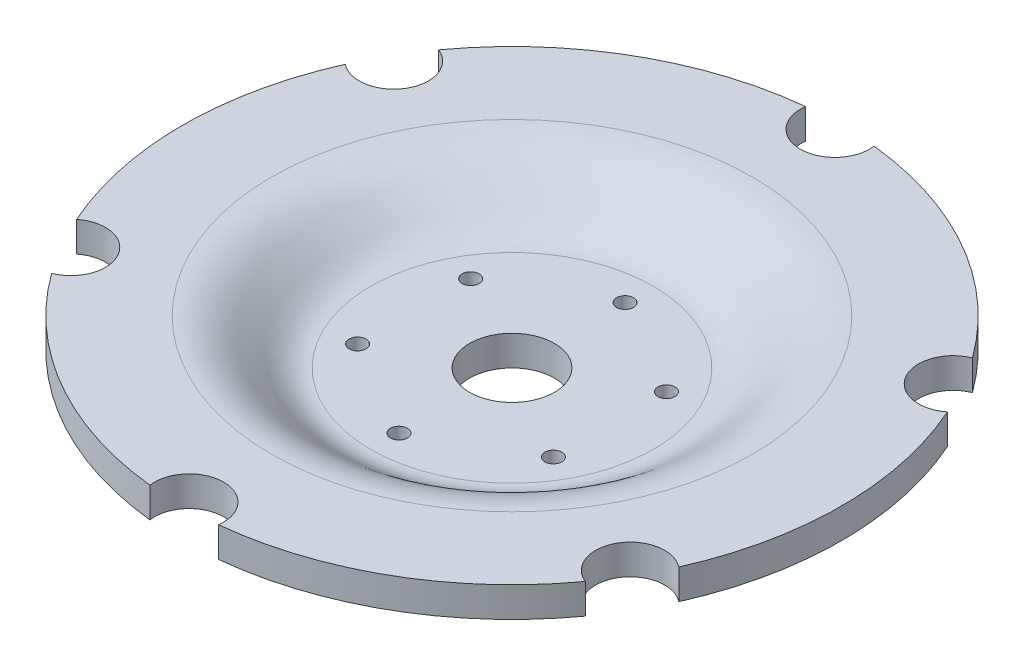
ISO-10303-21;
HEADER;
FILE_DESCRIPTION(('STEP AP214'),'2;1');
FILE_NAME('part.step','',(''),(''),'','','');
FILE_SCHEMA(('AUTOMOTIVE_DESIGN { 1 0 10303 214 1 1 1 1 }'));
ENDSEC;
DATA;
#1=APPLICATION_CONTEXT('core data for automotive mechanical design processes');
#2=APPLICATION_PROTOCOL_DEFINITION('international standard','automotive_design',2000,#1);
#3=PRODUCT_CONTEXT('',#1,'mechanical');
#4=PRODUCT('Part','Part','',(#3));
#5=PRODUCT_RELATED_PRODUCT_CATEGORY('part','',(#4));
#6=PRODUCT_DEFINITION_FORMATION('','',#4);
#7=PRODUCT_DEFINITION_CONTEXT('part definition',#1,'design');
#8=PRODUCT_DEFINITION('design','',#6,#7);
#9=PRODUCT_DEFINITION_SHAPE('','',#8);
#10=(LENGTH_UNIT() NAMED_UNIT(*) SI_UNIT(.MILLI.,.METRE.));
#11=(NAMED_UNIT(*) PLANE_ANGLE_UNIT() SI_UNIT($,.RADIAN.));
#12=(NAMED_UNIT(*) SI_UNIT($,.STERADIAN.) SOLID_ANGLE_UNIT());
#13=UNCERTAINTY_MEASURE_WITH_UNIT(LENGTH_MEASURE(1.E-05),#10,'distance_accuracy_value','');
#14=(GEOMETRIC_REPRESENTATION_CONTEXT(3) GLOBAL_UNCERTAINTY_ASSIGNED_CONTEXT((#13)) GLOBAL_UNIT_ASSIGNED_CONTEXT((#10,
#11,#12)) REPRESENTATION_CONTEXT('',''));
#15=CARTESIAN_POINT('',(0.,0.,0.));
#16=DIRECTION('',(0.,0.,1.));
#17=DIRECTION('',(1.,0.,0.));
#18=AXIS2_PLACEMENT_3D('',#15,#16,#17);
#19=CARTESIAN_POINT('',(0.,-21.28,0.));
#20=DIRECTION('',(0.,-1.,0.));
#21=DIRECTION('',(0.,0.,-1.));
#22=AXIS2_PLACEMENT_3D('',#19,#20,#21);
#23=PLANE('',#22);
#24=CARTESIAN_POINT('',(0.,-21.28,0.));
#25=DIRECTION('',(0.,1.,0.));
#26=DIRECTION('',(0.,0.,1.));
#27=AXIS2_PLACEMENT_3D('',#24,#25,#26);
#28=CIRCLE('',#27,14.1);
#29=CARTESIAN_POINT('',(0.,-21.28,14.1));
#30=VERTEX_POINT('',#29);
#31=EDGE_CURVE('E285',#30,#30,#28,.T.);
#32=ORIENTED_EDGE('',*,*,#31,.T.);
#33=EDGE_LOOP('',(#32));
#34=FACE_BOUND('',#33,.T.);
#35=CARTESIAN_POINT('',(-32.5625551822947,-21.28,-18.8000000000004));
#36=DIRECTION('',(0.,1.,0.));
#37=DIRECTION('',(0.,0.,1.));
#38=AXIS2_PLACEMENT_3D('',#35,#36,#37);
#39=CIRCLE('',#38,2.82);
#40=CARTESIAN_POINT('',(-32.5625551822947,-21.28,-15.9800000000004));
#41=VERTEX_POINT('',#40);
#42=EDGE_CURVE('E289',#41,#41,#39,.T.);
#43=ORIENTED_EDGE('',*,*,#42,.T.);
#44=EDGE_LOOP('',(#43));
#45=FACE_BOUND('',#44,.T.);
#46=CARTESIAN_POINT('',(0.,-21.28,-37.6));
#47=DIRECTION('',(0.,1.,0.));
#48=DIRECTION('',(0.,0.,1.));
#49=AXIS2_PLACEMENT_3D('',#46,#47,#48);
#50=CIRCLE('',#49,2.82);
#51=CARTESIAN_POINT('',(0.,-21.28,-34.78));
#52=VERTEX_POINT('',#51);
#53=EDGE_CURVE('E293',#52,#52,#50,.T.);
#54=ORIENTED_EDGE('',*,*,#53,.T.);
#55=EDGE_LOOP('',(#54));
#56=FACE_BOUND('',#55,.T.);
#57=CARTESIAN_POINT('',(32.562555182295,-21.28,-18.8));
#58=DIRECTION('',(0.,1.,0.));
#59=DIRECTION('',(0.,0.,1.));
#60=AXIS2_PLACEMENT_3D('',#57,#58,#59);
#61=CIRCLE('',#60,2.82);
#62=CARTESIAN_POINT('',(32.562555182295,-21.28,-15.98));
#63=VERTEX_POINT('',#62);
#64=EDGE_CURVE('E297',#63,#63,#61,.T.);
#65=ORIENTED_EDGE('',*,*,#64,.T.);
#66=EDGE_LOOP('',(#65));
#67=FACE_BOUND('',#66,.T.);
#68=CARTESIAN_POINT('',(32.5625551822981,-21.28,18.7999999999981));
#69=DIRECTION('',(0.,1.,0.));
#70=DIRECTION('',(0.,0.,1.));
#71=AXIS2_PLACEMENT_3D('',#68,#69,#70);
#72=CIRCLE('',#71,2.82);
#73=CARTESIAN_POINT('',(32.5625551822981,-21.28,21.6199999999981));
#74=VERTEX_POINT('',#73);
#75=EDGE_CURVE('E301',#74,#74,#72,.T.);
#76=ORIENTED_EDGE('',*,*,#75,.T.);
#77=EDGE_LOOP('',(#76));
#78=FACE_BOUND('',#77,.T.);
#79=CARTESIAN_POINT('',(0.,-21.28,0.));
#80=DIRECTION('',(0.,1.,0.));
#81=DIRECTION('',(0.,0.,1.));
#82=AXIS2_PLACEMENT_3D('',#79,#80,#81);
#83=CIRCLE('',#82,47.0000000000002);
#84=CARTESIAN_POINT('',(0.,-21.28,47.0000000000002));
#85=VERTEX_POINT('',#84);
#86=EDGE_CURVE('E203',#85,#85,#83,.T.);
#87=ORIENTED_EDGE('',*,*,#86,.F.);
#88=EDGE_LOOP('',(#87));
#89=FACE_BOUND('',#88,.T.);
#90=CARTESIAN_POINT('',(-32.5625551822917,-21.28,18.8000000000019));
#91=DIRECTION('',(0.,1.,0.));
#92=DIRECTION('',(0.,0.,1.));
#93=AXIS2_PLACEMENT_3D('',#90,#91,#92);
#94=CIRCLE('',#93,2.82);
#95=CARTESIAN_POINT('',(-32.5625551822917,-21.28,21.6200000000018));
#96=VERTEX_POINT('',#95);
#97=EDGE_CURVE('E307',#96,#96,#94,.T.);
#98=ORIENTED_EDGE('',*,*,#97,.T.);
#99=EDGE_LOOP('',(#98));
#100=FACE_BOUND('',#99,.T.);
#101=CARTESIAN_POINT('',(4.26541575440318E-12,-21.28,37.6));
#102=DIRECTION('',(0.,1.,0.));
#103=DIRECTION('',(0.,0.,1.));
#104=AXIS2_PLACEMENT_3D('',#101,#102,#103);
#105=CIRCLE('',#104,2.82);
#106=CARTESIAN_POINT('',(4.26541575440318E-12,-21.28,40.42));
#107=VERTEX_POINT('',#106);
#108=EDGE_CURVE('E310',#107,#107,#105,.T.);
#109=ORIENTED_EDGE('',*,*,#108,.T.);
#110=EDGE_LOOP('',(#109));
#111=FACE_BOUND('',#110,.T.);
#112=ADVANCED_FACE('F45',(#34,#45,#56,#67,#78,#89,#100,#111),#23,.T.);
#113=CARTESIAN_POINT('',(0.,-15.0433244229354,0.));
#114=DIRECTION('',(0.,1.,0.));
#115=DIRECTION('',(0.,0.,1.));
#116=AXIS2_PLACEMENT_3D('',#113,#114,#115);
#117=CYLINDRICAL_SURFACE('',#116,109.626011544447);
#118=DIRECTION('',(0.,1.,0.));
#119=VECTOR('',#118,1.);
#120=CARTESIAN_POINT('',(-100.116479710272,-8.76000000000002,-44.6604175704388));
#121=LINE('',#120,#119);
#122=CARTESIAN_POINT('',(-100.116479710272,-6.24000000000001,-44.6604175704389));
#123=VERTEX_POINT('',#122);
#124=CARTESIAN_POINT('',(-100.116479710272,3.75999999999999,-44.6604175704389));
#125=VERTEX_POINT('',#124);
#126=EDGE_CURVE('E59',#123,#125,#121,.T.);
#127=ORIENTED_EDGE('',*,*,#126,.F.);
#128=CARTESIAN_POINT('',(0.,-6.24,0.));
#129=DIRECTION('',(0.,1.,0.));
#130=DIRECTION('',(0.,0.,1.));
#131=AXIS2_PLACEMENT_3D('',#128,#129,#130);
#132=CIRCLE('',#131,109.626011544447);
#133=CARTESIAN_POINT('',(-100.11647971027,-6.24,44.6604175704429));
#134=VERTEX_POINT('',#133);
#135=EDGE_CURVE('E170',#123,#134,#132,.T.);
#136=ORIENTED_EDGE('',*,*,#135,.T.);
#137=DIRECTION('',(0.,1.,0.));
#138=VECTOR('',#137,1.);
#139=CARTESIAN_POINT('',(-100.11647971027,-8.76,44.6604175704429));
#140=LINE('',#139,#138);
#141=CARTESIAN_POINT('',(-100.11647971027,3.76000000000001,44.6604175704429));
#142=VERTEX_POINT('',#141);
#143=EDGE_CURVE('E200',#142,#134,#140,.F.);
#144=ORIENTED_EDGE('',*,*,#143,.F.);
#145=CARTESIAN_POINT('',(0.,3.76,0.));
#146=DIRECTION('',(0.,1.,0.));
#147=DIRECTION('',(0.,0.,1.));
#148=AXIS2_PLACEMENT_3D('',#145,#146,#147);
#149=CIRCLE('',#148,109.626011544447);
#150=EDGE_CURVE('E153',#125,#142,#149,.T.);
#151=ORIENTED_EDGE('',*,*,#150,.F.);
#152=EDGE_LOOP('',(#127,#136,#144,#151));
#153=FACE_BOUND('',#152,.T.);
#154=ADVANCED_FACE('F270',(#153),#117,.T.);
#155=DIRECTION('',(0.,1.,0.));
#156=VECTOR('',#155,1.);
#157=CARTESIAN_POINT('',(100.116479710273,-8.76,44.6604175704364));
#158=LINE('',#157,#156);
#159=CARTESIAN_POINT('',(100.116479710273,-6.23999999999999,44.6604175704365));
#160=VERTEX_POINT('',#159);
#161=CARTESIAN_POINT('',(100.116479710273,3.76000000000001,44.6604175704365));
#162=VERTEX_POINT('',#161);
#163=EDGE_CURVE('E67',#160,#162,#158,.T.);
#164=ORIENTED_EDGE('',*,*,#163,.F.);
#165=CARTESIAN_POINT('',(100.116479710271,-6.24000000000001,-44.6604175704404));
#166=VERTEX_POINT('',#165);
#167=EDGE_CURVE('E190',#160,#166,#132,.T.);
#168=ORIENTED_EDGE('',*,*,#167,.T.);
#169=DIRECTION('',(0.,1.,0.));
#170=VECTOR('',#169,1.);
#171=CARTESIAN_POINT('',(100.116479710271,-8.76000000000002,-44.6604175704404));
#172=LINE('',#171,#170);
#173=CARTESIAN_POINT('',(100.116479710271,3.75999999999999,-44.6604175704404));
#174=VERTEX_POINT('',#173);
#175=EDGE_CURVE('E183',#174,#166,#172,.F.);
#176=ORIENTED_EDGE('',*,*,#175,.F.);
#177=EDGE_CURVE('E156',#162,#174,#149,.T.);
#178=ORIENTED_EDGE('',*,*,#177,.F.);
#179=EDGE_LOOP('',(#164,#168,#176,#178));
#180=FACE_BOUND('',#179,.T.);
#181=ADVANCED_FACE('F188',(#180),#117,.T.);
#182=DIRECTION('',(0.,1.,0.));
#183=VECTOR('',#182,1.);
#184=CARTESIAN_POINT('',(88.7352960147567,-8.76000000000002,-64.3732059813459));
#185=LINE('',#184,#183);
#186=CARTESIAN_POINT('',(88.7352960147567,-6.24000000000001,-64.3732059813458));
#187=VERTEX_POINT('',#186);
#188=CARTESIAN_POINT('',(88.7352960147567,3.75999999999999,-64.3732059813458));
#189=VERTEX_POINT('',#188);
#190=EDGE_CURVE('E53',#187,#189,#185,.T.);
#191=ORIENTED_EDGE('',*,*,#190,.F.);
#192=CARTESIAN_POINT('',(11.3811836955142,-6.24000000000002,-109.033623551784));
#193=VERTEX_POINT('',#192);
#194=EDGE_CURVE('E213',#187,#193,#132,.T.);
#195=ORIENTED_EDGE('',*,*,#194,.T.);
#196=DIRECTION('',(0.,1.,0.));
#197=VECTOR('',#196,1.);
#198=CARTESIAN_POINT('',(11.3811836955142,-8.76000000000003,-109.033623551784));
#199=LINE('',#198,#197);
#200=CARTESIAN_POINT('',(11.3811836955142,3.75999999999998,-109.033623551784));
#201=VERTEX_POINT('',#200);
#202=EDGE_CURVE('E193',#201,#193,#199,.F.);
#203=ORIENTED_EDGE('',*,*,#202,.F.);
#204=EDGE_CURVE('E152',#189,#201,#149,.T.);
#205=ORIENTED_EDGE('',*,*,#204,.F.);
#206=EDGE_LOOP('',(#191,#195,#203,#205));
#207=FACE_BOUND('',#206,.T.);
#208=ADVANCED_FACE('F220',(#207),#117,.T.);
#209=DIRECTION('',(0.,1.,0.));
#210=VECTOR('',#209,1.);
#211=CARTESIAN_POINT('',(-88.7352960147583,-8.76000000000002,-64.3732059813435));
#212=LINE('',#211,#210);
#213=CARTESIAN_POINT('',(-88.7352960147583,3.75999999999999,-64.3732059813435));
#214=VERTEX_POINT('',#213);
#215=CARTESIAN_POINT('',(-88.7352960147583,-6.24000000000001,-64.3732059813435));
#216=VERTEX_POINT('',#215);
#217=EDGE_CURVE('E132',#214,#216,#212,.F.);
#218=ORIENTED_EDGE('',*,*,#217,.F.);
#219=CARTESIAN_POINT('',(-11.3811836955142,3.75999999999998,-109.033623551784));
#220=VERTEX_POINT('',#219);
#221=EDGE_CURVE('E142',#220,#214,#149,.T.);
#222=ORIENTED_EDGE('',*,*,#221,.F.);
#223=DIRECTION('',(0.,1.,0.));
#224=VECTOR('',#223,1.);
#225=CARTESIAN_POINT('',(-11.3811836955142,-8.76000000000003,-109.033623551784));
#226=LINE('',#225,#224);
#227=CARTESIAN_POINT('',(-11.3811836955142,-6.24000000000002,-109.033623551784));
#228=VERTEX_POINT('',#227);
#229=EDGE_CURVE('E191',#228,#220,#226,.T.);
#230=ORIENTED_EDGE('',*,*,#229,.F.);
#231=EDGE_CURVE('E144',#228,#216,#132,.T.);
#232=ORIENTED_EDGE('',*,*,#231,.T.);
#233=EDGE_LOOP('',(#218,#222,#230,#232));
#234=FACE_BOUND('',#233,.T.);
#235=ADVANCED_FACE('F140',(#234),#117,.T.);
#236=DIRECTION('',(0.,1.,0.));
#237=VECTOR('',#236,1.);
#238=CARTESIAN_POINT('',(-88.7352960147557,-8.76,64.3732059813472));
#239=LINE('',#238,#237);
#240=CARTESIAN_POINT('',(-88.7352960147557,-6.23999999999999,64.3732059813472));
#241=VERTEX_POINT('',#240);
#242=CARTESIAN_POINT('',(-88.7352960147557,3.76000000000001,64.3732059813472));
#243=VERTEX_POINT('',#242);
#244=EDGE_CURVE('E198',#241,#243,#239,.T.);
#245=ORIENTED_EDGE('',*,*,#244,.F.);
#246=CARTESIAN_POINT('',(-11.3811836954952,-6.23999999999998,109.033623551786));
#247=VERTEX_POINT('',#246);
#248=EDGE_CURVE('E168',#241,#247,#132,.T.);
#249=ORIENTED_EDGE('',*,*,#248,.T.);
#250=DIRECTION('',(0.,1.,0.));
#251=VECTOR('',#250,1.);
#252=CARTESIAN_POINT('',(-11.3811836954952,-8.75999999999999,109.033623551786));
#253=LINE('',#252,#251);
#254=CARTESIAN_POINT('',(-11.3811836954952,3.76000000000002,109.033623551786));
#255=VERTEX_POINT('',#254);
#256=EDGE_CURVE('E239',#255,#247,#253,.F.);
#257=ORIENTED_EDGE('',*,*,#256,.F.);
#258=EDGE_CURVE('E155',#243,#255,#149,.T.);
#259=ORIENTED_EDGE('',*,*,#258,.F.);
#260=EDGE_LOOP('',(#245,#249,#257,#259));
#261=FACE_BOUND('',#260,.T.);
#262=ADVANCED_FACE('F271',(#261),#117,.T.);
#263=CARTESIAN_POINT('',(0.,-11.28,0.));
#264=DIRECTION('',(0.,1.,0.));
#265=DIRECTION('',(0.,0.,1.));
#266=AXIS2_PLACEMENT_3D('',#263,#264,#265);
#267=PLANE('',#266);
#268=CARTESIAN_POINT('',(0.,-11.28,0.));
#269=DIRECTION('',(0.,1.,0.));
#270=DIRECTION('',(0.,0.,1.));
#271=AXIS2_PLACEMENT_3D('',#268,#269,#270);
#272=CIRCLE('',#271,14.1);
#273=CARTESIAN_POINT('',(0.,-11.28,14.1));
#274=VERTEX_POINT('',#273);
#275=EDGE_CURVE('E384',#274,#274,#272,.T.);
#276=ORIENTED_EDGE('',*,*,#275,.F.);
#277=EDGE_LOOP('',(#276));
#278=FACE_BOUND('',#277,.T.);
#279=CARTESIAN_POINT('',(-32.5625551822947,-11.28,-18.8000000000004));
#280=DIRECTION('',(0.,1.,0.));
#281=DIRECTION('',(0.,0.,1.));
#282=AXIS2_PLACEMENT_3D('',#279,#280,#281);
#283=CIRCLE('',#282,2.81999999999999);
#284=CARTESIAN_POINT('',(-32.5625551822947,-11.28,-15.9800000000004));
#285=VERTEX_POINT('',#284);
#286=EDGE_CURVE('E387',#285,#285,#283,.T.);
#287=ORIENTED_EDGE('',*,*,#286,.F.);
#288=EDGE_LOOP('',(#287));
#289=FACE_BOUND('',#288,.T.);
#290=CARTESIAN_POINT('',(0.,-11.28,-37.6));
#291=DIRECTION('',(0.,1.,0.));
#292=DIRECTION('',(0.,0.,1.));
#293=AXIS2_PLACEMENT_3D('',#290,#291,#292);
#294=CIRCLE('',#293,2.81999999999999);
#295=CARTESIAN_POINT('',(0.,-11.28,-34.78));
#296=VERTEX_POINT('',#295);
#297=EDGE_CURVE('E393',#296,#296,#294,.T.);
#298=ORIENTED_EDGE('',*,*,#297,.F.);
#299=EDGE_LOOP('',(#298));
#300=FACE_BOUND('',#299,.T.);
#301=CARTESIAN_POINT('',(32.562555182295,-11.28,-18.8));
#302=DIRECTION('',(0.,1.,0.));
#303=DIRECTION('',(0.,0.,1.));
#304=AXIS2_PLACEMENT_3D('',#301,#302,#303);
#305=CIRCLE('',#304,2.81999999999999);
#306=CARTESIAN_POINT('',(32.562555182295,-11.28,-15.98));
#307=VERTEX_POINT('',#306);
#308=EDGE_CURVE('E397',#307,#307,#305,.T.);
#309=ORIENTED_EDGE('',*,*,#308,.F.);
#310=EDGE_LOOP('',(#309));
#311=FACE_BOUND('',#310,.T.);
#312=CARTESIAN_POINT('',(32.5625551822981,-11.28,18.7999999999981));
#313=DIRECTION('',(0.,1.,0.));
#314=DIRECTION('',(0.,0.,1.));
#315=AXIS2_PLACEMENT_3D('',#312,#313,#314);
#316=CIRCLE('',#315,2.81999999999999);
#317=CARTESIAN_POINT('',(32.5625551822981,-11.28,21.6199999999981));
#318=VERTEX_POINT('',#317);
#319=EDGE_CURVE('E401',#318,#318,#316,.T.);
#320=ORIENTED_EDGE('',*,*,#319,.F.);
#321=EDGE_LOOP('',(#320));
#322=FACE_BOUND('',#321,.T.);
#323=CARTESIAN_POINT('',(4.26541575440318E-12,-11.28,37.6));
#324=DIRECTION('',(0.,1.,0.));
#325=DIRECTION('',(0.,0.,1.));
#326=AXIS2_PLACEMENT_3D('',#323,#324,#325);
#327=CIRCLE('',#326,2.81999999999999);
#328=CARTESIAN_POINT('',(4.26541575440318E-12,-11.28,40.42));
#329=VERTEX_POINT('',#328);
#330=EDGE_CURVE('E313',#329,#329,#327,.T.);
#331=ORIENTED_EDGE('',*,*,#330,.F.);
#332=EDGE_LOOP('',(#331));
#333=FACE_BOUND('',#332,.T.);
#334=CARTESIAN_POINT('',(-32.5625551822917,-11.28,18.8000000000019));
#335=DIRECTION('',(0.,1.,0.));
#336=DIRECTION('',(0.,0.,1.));
#337=AXIS2_PLACEMENT_3D('',#334,#335,#336);
#338=CIRCLE('',#337,2.81999999999999);
#339=CARTESIAN_POINT('',(-32.5625551822917,-11.28,21.6200000000018));
#340=VERTEX_POINT('',#339);
#341=EDGE_CURVE('E312',#340,#340,#338,.T.);
#342=ORIENTED_EDGE('',*,*,#341,.F.);
#343=EDGE_LOOP('',(#342));
#344=FACE_BOUND('',#343,.T.);
#345=CARTESIAN_POINT('',(0.,-11.28,0.));
#346=DIRECTION('',(0.,1.,0.));
#347=DIRECTION('',(0.,0.,1.));
#348=AXIS2_PLACEMENT_3D('',#345,#346,#347);
#349=CIRCLE('',#348,47.);
#350=CARTESIAN_POINT('',(0.,-11.28,47.));
#351=VERTEX_POINT('',#350);
#352=EDGE_CURVE('E166',#351,#351,#349,.T.);
#353=ORIENTED_EDGE('',*,*,#352,.T.);
#354=EDGE_LOOP('',(#353));
#355=FACE_BOUND('',#354,.T.);
#356=ADVANCED_FACE('F47',(#278,#289,#300,#311,#322,#333,#344,#355),#267,.T.);
#357=CARTESIAN_POINT('',(79.9,-6.24,0.));
#358=CARTESIAN_POINT('',(79.5814219048359,-6.24,0.));
#359=CARTESIAN_POINT('',(78.9274629999967,-6.26135514550307,0.));
#360=CARTESIAN_POINT('',(77.7578426696443,-6.37664196986913,0.));
#361=CARTESIAN_POINT('',(76.3667583016656,-6.65192998526286,0.));
#362=CARTESIAN_POINT('',(74.8239491144071,-7.16288550630177,0.));
#363=CARTESIAN_POINT('',(72.7883973936226,-8.09443504718028,0.));
#364=CARTESIAN_POINT('',(70.2209148985642,-9.72699602605355,0.));
#365=CARTESIAN_POINT('',(66.9206940326988,-12.3328310892076,0.));
#366=CARTESIAN_POINT('',(63.2491847703619,-15.3017782132427,0.));
#367=CARTESIAN_POINT('',(59.6386253805314,-17.7605205155428,0.));
#368=CARTESIAN_POINT('',(56.2437732055035,-19.4391988412004,0.));
#369=CARTESIAN_POINT('',(53.4143313725907,-20.4534612437412,0.));
#370=CARTESIAN_POINT('',(50.3552086088509,-21.1198170005363,0.));
#371=CARTESIAN_POINT('',(48.1033977983843,-21.28,0.));
#372=CARTESIAN_POINT('',(47.0000000000002,-21.28,0.));
#373=B_SPLINE_CURVE_WITH_KNOTS('',3,(#357,#358,#359,#360,#361,#362,#363,#364,#365,#366,#367,
#368,#369,#370,#371,#372),.UNSPECIFIED.,.F.,.F.,(4,1,1,1,1,1,1,1,1,1,1,1,1,4),(0.,0.03125,
0.0625,0.125,0.1875,0.25,0.375,0.5,0.625,0.75,0.8125,0.875,0.9375,1.),.UNSPECIFIED.);
#374=CARTESIAN_POINT('',(0.,-15.0433244229354,0.));
#375=DIRECTION('',(0.,1.,0.));
#376=AXIS1_PLACEMENT('',#374,#375);
#377=SURFACE_OF_REVOLUTION('',#373,#376);
#378=ORIENTED_EDGE('',*,*,#86,.T.);
#379=EDGE_LOOP('',(#378));
#380=FACE_BOUND('',#379,.T.);
#381=CARTESIAN_POINT('',(0.,-6.24,0.));
#382=DIRECTION('',(0.,1.,0.));
#383=DIRECTION('',(0.,0.,1.));
#384=AXIS2_PLACEMENT_3D('',#381,#382,#383);
#385=CIRCLE('',#384,79.9);
#386=CARTESIAN_POINT('',(0.,-6.23999999999999,79.9));
#387=VERTEX_POINT('',#386);
#388=EDGE_CURVE('E206',#387,#387,#385,.T.);
#389=ORIENTED_EDGE('',*,*,#388,.F.);
#390=EDGE_LOOP('',(#389));
#391=FACE_BOUND('',#390,.T.);
#392=ADVANCED_FACE('F274',(#380,#391),#377,.F.);
#393=CARTESIAN_POINT('',(79.9,-6.24,0.));
#394=DIRECTION('',(0.,-1.,0.));
#395=DIRECTION('',(0.,0.,-1.));
#396=AXIS2_PLACEMENT_3D('',#393,#394,#395);
#397=PLANE('',#396);
#398=CARTESIAN_POINT('',(-92.9979546474359,-6.24000000000001,-53.6923941497804));
#399=DIRECTION('',(0.,-1.,0.));
#400=DIRECTION('',(0.,0.,-1.));
#401=AXIS2_PLACEMENT_3D('',#398,#399,#400);
#402=CIRCLE('',#401,11.5);
#403=EDGE_CURVE('E145',#216,#123,#402,.T.);
#404=ORIENTED_EDGE('',*,*,#403,.F.);
#405=ORIENTED_EDGE('',*,*,#231,.F.);
#406=CARTESIAN_POINT('',(0.,-6.24000000000002,-107.384788299565));
#407=DIRECTION('',(0.,-1.,0.));
#408=DIRECTION('',(0.,0.,-1.));
#409=AXIS2_PLACEMENT_3D('',#406,#407,#408);
#410=CIRCLE('',#409,11.5);
#411=EDGE_CURVE('E225',#193,#228,#410,.T.);
#412=ORIENTED_EDGE('',*,*,#411,.F.);
#413=ORIENTED_EDGE('',*,*,#194,.F.);
#414=CARTESIAN_POINT('',(92.997954647438,-6.24000000000001,-53.6923941497842));
#415=DIRECTION('',(0.,-1.,0.));
#416=DIRECTION('',(0.,0.,-1.));
#417=AXIS2_PLACEMENT_3D('',#414,#415,#416);
#418=CIRCLE('',#417,11.5);
#419=EDGE_CURVE('E186',#166,#187,#418,.T.);
#420=ORIENTED_EDGE('',*,*,#419,.F.);
#421=ORIENTED_EDGE('',*,*,#167,.F.);
#422=CARTESIAN_POINT('',(92.9979546474402,-6.23999999999999,53.6923941497805));
#423=DIRECTION('',(0.,-1.,0.));
#424=DIRECTION('',(0.,0.,-1.));
#425=AXIS2_PLACEMENT_3D('',#422,#423,#424);
#426=CIRCLE('',#425,11.5);
#427=CARTESIAN_POINT('',(88.7352960147592,-6.23999999999999,64.3732059813423));
#428=VERTEX_POINT('',#427);
#429=EDGE_CURVE('E327',#428,#160,#426,.T.);
#430=ORIENTED_EDGE('',*,*,#429,.F.);
#431=CARTESIAN_POINT('',(11.3811836955352,-6.23999999999999,109.033623551782));
#432=VERTEX_POINT('',#431);
#433=EDGE_CURVE('E171',#432,#428,#132,.T.);
#434=ORIENTED_EDGE('',*,*,#433,.F.);
#435=CARTESIAN_POINT('',(1.96214344722274E-11,-6.23999999999999,107.384788299571));
#436=DIRECTION('',(0.,-1.,0.));
#437=DIRECTION('',(0.,0.,-1.));
#438=AXIS2_PLACEMENT_3D('',#435,#436,#437);
#439=CIRCLE('',#438,11.5);
#440=EDGE_CURVE('E242',#247,#432,#439,.T.);
#441=ORIENTED_EDGE('',*,*,#440,.F.);
#442=ORIENTED_EDGE('',*,*,#248,.F.);
#443=CARTESIAN_POINT('',(-92.9979546474337,-6.23999999999999,53.6923941497842));
#444=DIRECTION('',(0.,-1.,0.));
#445=DIRECTION('',(0.,0.,-1.));
#446=AXIS2_PLACEMENT_3D('',#443,#444,#445);
#447=CIRCLE('',#446,11.5);
#448=EDGE_CURVE('E231',#134,#241,#447,.T.);
#449=ORIENTED_EDGE('',*,*,#448,.F.);
#450=ORIENTED_EDGE('',*,*,#135,.F.);
#451=EDGE_LOOP('',(#404,#405,#412,#413,#420,#421,#430,#434,#441,#442,#449,#450));
#452=FACE_BOUND('',#451,.T.);
#453=ORIENTED_EDGE('',*,*,#388,.T.);
#454=EDGE_LOOP('',(#453));
#455=FACE_BOUND('',#454,.T.);
#456=ADVANCED_FACE('F226',(#452,#455),#397,.T.);
#457=DIRECTION('',(0.,1.,0.));
#458=VECTOR('',#457,1.);
#459=CARTESIAN_POINT('',(88.7352960147592,-8.76,64.3732059813423));
#460=LINE('',#459,#458);
#461=CARTESIAN_POINT('',(88.7352960147592,3.76000000000001,64.3732059813423));
#462=VERTEX_POINT('',#461);
#463=EDGE_CURVE('E325',#462,#428,#460,.F.);
#464=ORIENTED_EDGE('',*,*,#463,.F.);
#465=CARTESIAN_POINT('',(11.3811836955352,3.76000000000002,109.033623551782));
#466=VERTEX_POINT('',#465);
#467=EDGE_CURVE('E157',#466,#462,#149,.T.);
#468=ORIENTED_EDGE('',*,*,#467,.F.);
#469=DIRECTION('',(0.,1.,0.));
#470=VECTOR('',#469,1.);
#471=CARTESIAN_POINT('',(11.3811836955351,-8.75999999999999,109.033623551782));
#472=LINE('',#471,#470);
#473=EDGE_CURVE('E244',#432,#466,#472,.T.);
#474=ORIENTED_EDGE('',*,*,#473,.F.);
#475=ORIENTED_EDGE('',*,*,#433,.T.);
#476=EDGE_LOOP('',(#464,#468,#474,#475));
#477=FACE_BOUND('',#476,.T.);
#478=ADVANCED_FACE('F267',(#477),#117,.T.);
#479=CARTESIAN_POINT('',(79.9,3.76,0.));
#480=DIRECTION('',(0.,1.,0.));
#481=DIRECTION('',(0.,0.,1.));
#482=AXIS2_PLACEMENT_3D('',#479,#480,#481);
#483=PLANE('',#482);
#484=CARTESIAN_POINT('',(-92.9979546474359,3.75999999999999,-53.6923941497804));
#485=DIRECTION('',(0.,1.,0.));
#486=DIRECTION('',(0.,0.,1.));
#487=AXIS2_PLACEMENT_3D('',#484,#485,#486);
#488=CIRCLE('',#487,11.5);
#489=EDGE_CURVE('E11',#125,#214,#488,.T.);
#490=ORIENTED_EDGE('',*,*,#489,.F.);
#491=ORIENTED_EDGE('',*,*,#150,.T.);
#492=CARTESIAN_POINT('',(-92.9979546474337,3.76000000000001,53.6923941497842));
#493=DIRECTION('',(0.,1.,0.));
#494=DIRECTION('',(0.,0.,1.));
#495=AXIS2_PLACEMENT_3D('',#492,#493,#494);
#496=CIRCLE('',#495,11.5);
#497=EDGE_CURVE('E228',#243,#142,#496,.T.);
#498=ORIENTED_EDGE('',*,*,#497,.F.);
#499=ORIENTED_EDGE('',*,*,#258,.T.);
#500=CARTESIAN_POINT('',(1.96214344722274E-11,3.76000000000002,107.384788299571));
#501=DIRECTION('',(0.,1.,0.));
#502=DIRECTION('',(0.,0.,1.));
#503=AXIS2_PLACEMENT_3D('',#500,#501,#502);
#504=CIRCLE('',#503,11.5);
#505=EDGE_CURVE('E237',#466,#255,#504,.T.);
#506=ORIENTED_EDGE('',*,*,#505,.F.);
#507=ORIENTED_EDGE('',*,*,#467,.T.);
#508=CARTESIAN_POINT('',(92.9979546474402,3.76000000000001,53.6923941497805));
#509=DIRECTION('',(0.,1.,0.));
#510=DIRECTION('',(0.,0.,1.));
#511=AXIS2_PLACEMENT_3D('',#508,#509,#510);
#512=CIRCLE('',#511,11.5);
#513=EDGE_CURVE('E177',#162,#462,#512,.T.);
#514=ORIENTED_EDGE('',*,*,#513,.F.);
#515=ORIENTED_EDGE('',*,*,#177,.T.);
#516=CARTESIAN_POINT('',(92.997954647438,3.75999999999999,-53.6923941497842));
#517=DIRECTION('',(0.,1.,0.));
#518=DIRECTION('',(0.,0.,1.));
#519=AXIS2_PLACEMENT_3D('',#516,#517,#518);
#520=CIRCLE('',#519,11.5);
#521=EDGE_CURVE('E175',#189,#174,#520,.T.);
#522=ORIENTED_EDGE('',*,*,#521,.F.);
#523=ORIENTED_EDGE('',*,*,#204,.T.);
#524=CARTESIAN_POINT('',(0.,3.75999999999998,-107.384788299565));
#525=DIRECTION('',(0.,1.,0.));
#526=DIRECTION('',(0.,0.,1.));
#527=AXIS2_PLACEMENT_3D('',#524,#525,#526);
#528=CIRCLE('',#527,11.5);
#529=EDGE_CURVE('E151',#220,#201,#528,.T.);
#530=ORIENTED_EDGE('',*,*,#529,.F.);
#531=ORIENTED_EDGE('',*,*,#221,.T.);
#532=EDGE_LOOP('',(#490,#491,#498,#499,#506,#507,#514,#515,#522,#523,#530,#531));
#533=FACE_BOUND('',#532,.T.);
#534=CARTESIAN_POINT('',(0.,3.76,0.));
#535=DIRECTION('',(0.,1.,0.));
#536=DIRECTION('',(0.,0.,1.));
#537=AXIS2_PLACEMENT_3D('',#534,#535,#536);
#538=CIRCLE('',#537,79.9);
#539=CARTESIAN_POINT('',(0.,3.76000000000001,79.9));
#540=VERTEX_POINT('',#539);
#541=EDGE_CURVE('E160',#540,#540,#538,.T.);
#542=ORIENTED_EDGE('',*,*,#541,.F.);
#543=EDGE_LOOP('',(#542));
#544=FACE_BOUND('',#543,.T.);
#545=ADVANCED_FACE('F148',(#533,#544),#483,.T.);
#546=CARTESIAN_POINT('',(47.,-11.28,0.));
#547=CARTESIAN_POINT('',(47.3237606234799,-11.28,0.));
#548=CARTESIAN_POINT('',(47.9824273995364,-11.2568011836151,0.));
#549=CARTESIAN_POINT('',(49.2058814811947,-11.1253375384842,0.));
#550=CARTESIAN_POINT('',(50.6524730385144,-10.8134604628352,0.));
#551=CARTESIAN_POINT('',(52.3036344875106,-10.2235996038593,0.));
#552=CARTESIAN_POINT('',(54.4659042580729,-9.16305009894689,0.));
#553=CARTESIAN_POINT('',(57.1691398201527,-7.35071188742741,0.));
#554=CARTESIAN_POINT('',(60.5597732734679,-4.61985367991297,0.));
#555=CARTESIAN_POINT('',(64.2716825606037,-1.67085073742768,0.));
#556=CARTESIAN_POINT('',(67.8471618880741,0.639817329772207,0.));
#557=CARTESIAN_POINT('',(71.1259979901646,2.15110495764982,0.));
#558=CARTESIAN_POINT('',(73.8104306056359,3.04251457067639,0.));
#559=CARTESIAN_POINT('',(76.2432505743064,3.52513130935001,0.));
#560=CARTESIAN_POINT('',(78.2918886877993,3.72549768266214,0.));
#561=CARTESIAN_POINT('',(79.3680087837357,3.76,0.));
#562=CARTESIAN_POINT('',(79.9,3.76,0.));
#563=B_SPLINE_CURVE_WITH_KNOTS('',3,(#546,#547,#548,#549,#550,#551,#552,#553,#554,#555,#556,
#557,#558,#559,#560,#561,#562),.UNSPECIFIED.,.F.,.F.,(4,1,1,1,1,1,1,1,1,1,1,1,1,1,4),(0.,
0.03125,0.0625,0.125,0.1875,0.25,0.375,0.5,0.625,0.75,0.8125,0.875,0.9375,0.96875,1.),.UNSPECIFIED.);
#564=CARTESIAN_POINT('',(0.,-15.0433244229354,0.));
#565=DIRECTION('',(0.,1.,0.));
#566=AXIS1_PLACEMENT('',#564,#565);
#567=SURFACE_OF_REVOLUTION('',#563,#566);
#568=ORIENTED_EDGE('',*,*,#541,.T.);
#569=EDGE_LOOP('',(#568));
#570=FACE_BOUND('',#569,.T.);
#571=ORIENTED_EDGE('',*,*,#352,.F.);
#572=EDGE_LOOP('',(#571));
#573=FACE_BOUND('',#572,.T.);
#574=ADVANCED_FACE('F258',(#570,#573),#567,.F.);
#575=CARTESIAN_POINT('',(1.96214344722274E-11,3.76000000000002,107.384788299571));
#576=DIRECTION('',(0.,1.,0.));
#577=DIRECTION('',(0.,0.,1.));
#578=AXIS2_PLACEMENT_3D('',#575,#576,#577);
#579=CYLINDRICAL_SURFACE('',#578,11.5);
#580=ORIENTED_EDGE('',*,*,#473,.T.);
#581=ORIENTED_EDGE('',*,*,#505,.T.);
#582=ORIENTED_EDGE('',*,*,#256,.T.);
#583=ORIENTED_EDGE('',*,*,#440,.T.);
#584=EDGE_LOOP('',(#580,#581,#582,#583));
#585=FACE_BOUND('',#584,.T.);
#586=ADVANCED_FACE('F262',(#585),#579,.F.);
#587=CARTESIAN_POINT('',(-92.9979546474337,3.76000000000001,53.6923941497842));
#588=DIRECTION('',(0.,1.,0.));
#589=DIRECTION('',(0.,0.,1.));
#590=AXIS2_PLACEMENT_3D('',#587,#588,#589);
#591=CYLINDRICAL_SURFACE('',#590,11.5);
#592=ORIENTED_EDGE('',*,*,#244,.T.);
#593=ORIENTED_EDGE('',*,*,#497,.T.);
#594=ORIENTED_EDGE('',*,*,#143,.T.);
#595=ORIENTED_EDGE('',*,*,#448,.T.);
#596=EDGE_LOOP('',(#592,#593,#594,#595));
#597=FACE_BOUND('',#596,.T.);
#598=ADVANCED_FACE('F339',(#597),#591,.F.);
#599=CARTESIAN_POINT('',(0.,3.75999999999998,-107.384788299565));
#600=DIRECTION('',(0.,1.,0.));
#601=DIRECTION('',(0.,0.,1.));
#602=AXIS2_PLACEMENT_3D('',#599,#600,#601);
#603=CYLINDRICAL_SURFACE('',#602,11.5);
#604=ORIENTED_EDGE('',*,*,#229,.T.);
#605=ORIENTED_EDGE('',*,*,#529,.T.);
#606=ORIENTED_EDGE('',*,*,#202,.T.);
#607=ORIENTED_EDGE('',*,*,#411,.T.);
#608=EDGE_LOOP('',(#604,#605,#606,#607));
#609=FACE_BOUND('',#608,.T.);
#610=ADVANCED_FACE('F224',(#609),#603,.F.);
#611=CARTESIAN_POINT('',(92.997954647438,3.75999999999999,-53.6923941497842));
#612=DIRECTION('',(0.,1.,0.));
#613=DIRECTION('',(0.,0.,1.));
#614=AXIS2_PLACEMENT_3D('',#611,#612,#613);
#615=CYLINDRICAL_SURFACE('',#614,11.5);
#616=ORIENTED_EDGE('',*,*,#190,.T.);
#617=ORIENTED_EDGE('',*,*,#521,.T.);
#618=ORIENTED_EDGE('',*,*,#175,.T.);
#619=ORIENTED_EDGE('',*,*,#419,.T.);
#620=EDGE_LOOP('',(#616,#617,#618,#619));
#621=FACE_BOUND('',#620,.T.);
#622=ADVANCED_FACE('F182',(#621),#615,.F.);
#623=CARTESIAN_POINT('',(92.9979546474402,3.76000000000001,53.6923941497805));
#624=DIRECTION('',(0.,1.,0.));
#625=DIRECTION('',(0.,0.,1.));
#626=AXIS2_PLACEMENT_3D('',#623,#624,#625);
#627=CYLINDRICAL_SURFACE('',#626,11.5);
#628=ORIENTED_EDGE('',*,*,#163,.T.);
#629=ORIENTED_EDGE('',*,*,#513,.T.);
#630=ORIENTED_EDGE('',*,*,#463,.T.);
#631=ORIENTED_EDGE('',*,*,#429,.T.);
#632=EDGE_LOOP('',(#628,#629,#630,#631));
#633=FACE_BOUND('',#632,.T.);
#634=ADVANCED_FACE('F330',(#633),#627,.F.);
#635=CARTESIAN_POINT('',(-92.9979546474359,3.75999999999999,-53.6923941497804));
#636=DIRECTION('',(0.,1.,0.));
#637=DIRECTION('',(0.,0.,1.));
#638=AXIS2_PLACEMENT_3D('',#635,#636,#637);
#639=CYLINDRICAL_SURFACE('',#638,11.5);
#640=ORIENTED_EDGE('',*,*,#126,.T.);
#641=ORIENTED_EDGE('',*,*,#489,.T.);
#642=ORIENTED_EDGE('',*,*,#217,.T.);
#643=ORIENTED_EDGE('',*,*,#403,.T.);
#644=EDGE_LOOP('',(#640,#641,#642,#643));
#645=FACE_BOUND('',#644,.T.);
#646=ADVANCED_FACE('F131',(#645),#639,.F.);
#647=CARTESIAN_POINT('',(-32.5625551822917,-11.28,18.8000000000019));
#648=DIRECTION('',(0.,1.,0.));
#649=DIRECTION('',(0.,0.,1.));
#650=AXIS2_PLACEMENT_3D('',#647,#648,#649);
#651=CYLINDRICAL_SURFACE('',#650,2.81999999999999);
#652=ORIENTED_EDGE('',*,*,#97,.F.);
#653=EDGE_LOOP('',(#652));
#654=FACE_BOUND('',#653,.T.);
#655=ORIENTED_EDGE('',*,*,#341,.T.);
#656=EDGE_LOOP('',(#655));
#657=FACE_BOUND('',#656,.T.);
#658=ADVANCED_FACE('F353',(#654,#657),#651,.F.);
#659=CARTESIAN_POINT('',(4.26541575440318E-12,-11.28,37.6));
#660=DIRECTION('',(0.,1.,0.));
#661=DIRECTION('',(0.,0.,1.));
#662=AXIS2_PLACEMENT_3D('',#659,#660,#661);
#663=CYLINDRICAL_SURFACE('',#662,2.81999999999999);
#664=ORIENTED_EDGE('',*,*,#108,.F.);
#665=EDGE_LOOP('',(#664));
#666=FACE_BOUND('',#665,.T.);
#667=ORIENTED_EDGE('',*,*,#330,.T.);
#668=EDGE_LOOP('',(#667));
#669=FACE_BOUND('',#668,.T.);
#670=ADVANCED_FACE('F356',(#666,#669),#663,.F.);
#671=CARTESIAN_POINT('',(32.5625551822981,-11.28,18.7999999999981));
#672=DIRECTION('',(0.,1.,0.));
#673=DIRECTION('',(0.,0.,1.));
#674=AXIS2_PLACEMENT_3D('',#671,#672,#673);
#675=CYLINDRICAL_SURFACE('',#674,2.81999999999999);
#676=ORIENTED_EDGE('',*,*,#75,.F.);
#677=EDGE_LOOP('',(#676));
#678=FACE_BOUND('',#677,.T.);
#679=ORIENTED_EDGE('',*,*,#319,.T.);
#680=EDGE_LOOP('',(#679));
#681=FACE_BOUND('',#680,.T.);
#682=ADVANCED_FACE('F360',(#678,#681),#675,.F.);
#683=CARTESIAN_POINT('',(32.562555182295,-11.28,-18.8));
#684=DIRECTION('',(0.,1.,0.));
#685=DIRECTION('',(0.,0.,1.));
#686=AXIS2_PLACEMENT_3D('',#683,#684,#685);
#687=CYLINDRICAL_SURFACE('',#686,2.81999999999999);
#688=ORIENTED_EDGE('',*,*,#64,.F.);
#689=EDGE_LOOP('',(#688));
#690=FACE_BOUND('',#689,.T.);
#691=ORIENTED_EDGE('',*,*,#308,.T.);
#692=EDGE_LOOP('',(#691));
#693=FACE_BOUND('',#692,.T.);
#694=ADVANCED_FACE('F363',(#690,#693),#687,.F.);
#695=CARTESIAN_POINT('',(0.,-11.28,-37.6));
#696=DIRECTION('',(0.,1.,0.));
#697=DIRECTION('',(0.,0.,1.));
#698=AXIS2_PLACEMENT_3D('',#695,#696,#697);
#699=CYLINDRICAL_SURFACE('',#698,2.81999999999999);
#700=ORIENTED_EDGE('',*,*,#53,.F.);
#701=EDGE_LOOP('',(#700));
#702=FACE_BOUND('',#701,.T.);
#703=ORIENTED_EDGE('',*,*,#297,.T.);
#704=EDGE_LOOP('',(#703));
#705=FACE_BOUND('',#704,.T.);
#706=ADVANCED_FACE('F367',(#702,#705),#699,.F.);
#707=CARTESIAN_POINT('',(-32.5625551822947,-11.28,-18.8000000000004));
#708=DIRECTION('',(0.,1.,0.));
#709=DIRECTION('',(0.,0.,1.));
#710=AXIS2_PLACEMENT_3D('',#707,#708,#709);
#711=CYLINDRICAL_SURFACE('',#710,2.81999999999999);
#712=ORIENTED_EDGE('',*,*,#42,.F.);
#713=EDGE_LOOP('',(#712));
#714=FACE_BOUND('',#713,.T.);
#715=ORIENTED_EDGE('',*,*,#286,.T.);
#716=EDGE_LOOP('',(#715));
#717=FACE_BOUND('',#716,.T.);
#718=ADVANCED_FACE('F371',(#714,#717),#711,.F.);
#719=CARTESIAN_POINT('',(0.,-11.28,0.));
#720=DIRECTION('',(0.,1.,0.));
#721=DIRECTION('',(0.,0.,1.));
#722=AXIS2_PLACEMENT_3D('',#719,#720,#721);
#723=CYLINDRICAL_SURFACE('',#722,14.1);
#724=ORIENTED_EDGE('',*,*,#31,.F.);
#725=EDGE_LOOP('',(#724));
#726=FACE_BOUND('',#725,.T.);
#727=ORIENTED_EDGE('',*,*,#275,.T.);
#728=EDGE_LOOP('',(#727));
#729=FACE_BOUND('',#728,.T.);
#730=ADVANCED_FACE('F375',(#726,#729),#723,.F.);
#731=CLOSED_SHELL('',(#112,#154,#181,#208,#235,#262,#356,#392,#456,#478,#545,#574,#586,#598,
#610,#622,#634,#646,#658,#670,#682,#694,#706,#718,#730));
#732=MANIFOLD_SOLID_BREP('B2',#731);
#733=ADVANCED_BREP_SHAPE_REPRESENTATION('',(#18,#732),#14);
#734=SHAPE_DEFINITION_REPRESENTATION(#9,#733);
ENDSEC;
END-ISO-10303-21;
